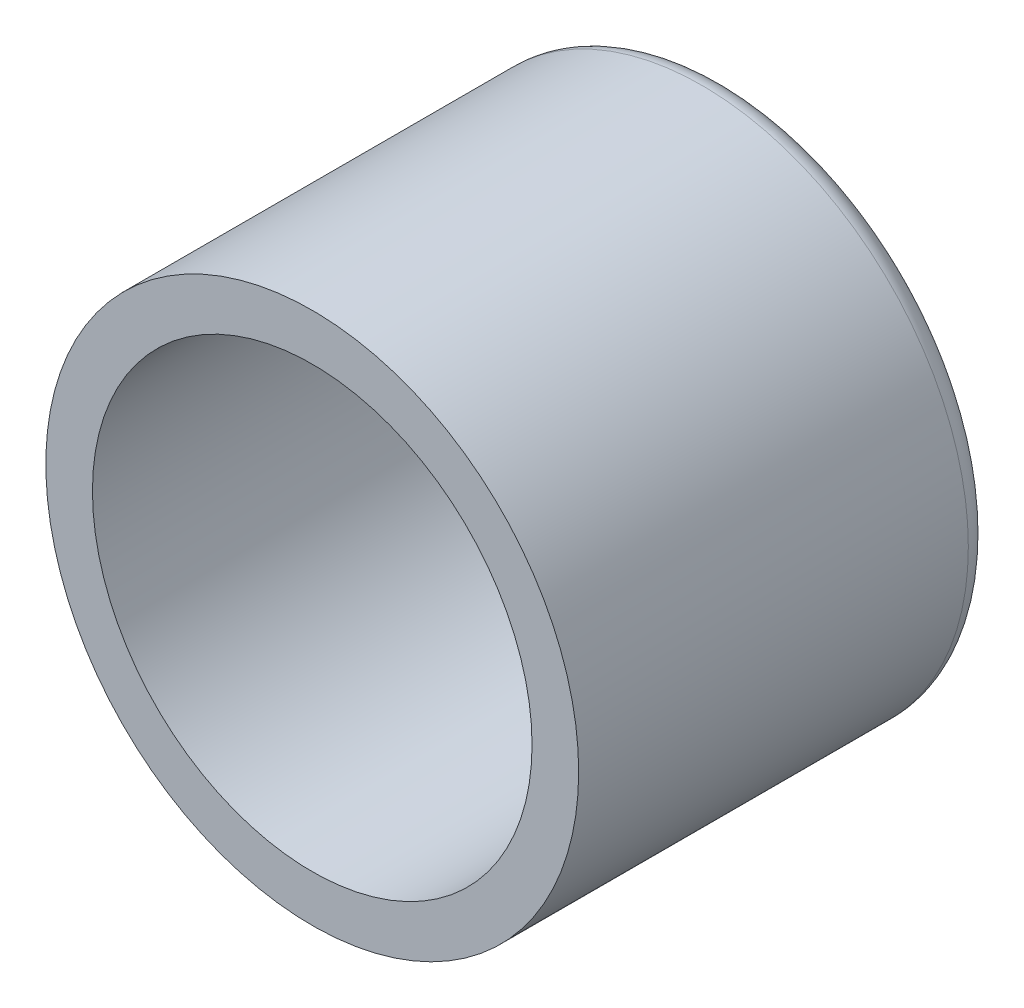
ISO-10303-21;
HEADER;
FILE_DESCRIPTION(('STEP AP214'),'2;1');
FILE_NAME('part.step','',(''),(''),'','','');
FILE_SCHEMA(('AUTOMOTIVE_DESIGN { 1 0 10303 214 1 1 1 1 }'));
ENDSEC;
DATA;
#1=APPLICATION_CONTEXT('core data for automotive mechanical design processes');
#2=APPLICATION_PROTOCOL_DEFINITION('international standard','automotive_design',2000,#1);
#3=PRODUCT_CONTEXT('',#1,'mechanical');
#4=PRODUCT('Part','Part','',(#3));
#5=PRODUCT_RELATED_PRODUCT_CATEGORY('part','',(#4));
#6=PRODUCT_DEFINITION_FORMATION('','',#4);
#7=PRODUCT_DEFINITION_CONTEXT('part definition',#1,'design');
#8=PRODUCT_DEFINITION('design','',#6,#7);
#9=PRODUCT_DEFINITION_SHAPE('','',#8);
#10=(LENGTH_UNIT() NAMED_UNIT(*) SI_UNIT(.MILLI.,.METRE.));
#11=(NAMED_UNIT(*) PLANE_ANGLE_UNIT() SI_UNIT($,.RADIAN.));
#12=(NAMED_UNIT(*) SI_UNIT($,.STERADIAN.) SOLID_ANGLE_UNIT());
#13=UNCERTAINTY_MEASURE_WITH_UNIT(LENGTH_MEASURE(1.E-05),#10,'distance_accuracy_value','');
#14=(GEOMETRIC_REPRESENTATION_CONTEXT(3) GLOBAL_UNCERTAINTY_ASSIGNED_CONTEXT((#13)) GLOBAL_UNIT_ASSIGNED_CONTEXT((#10,
#11,#12)) REPRESENTATION_CONTEXT('',''));
#15=CARTESIAN_POINT('',(0.,0.,0.));
#16=DIRECTION('',(0.,0.,1.));
#17=DIRECTION('',(1.,0.,0.));
#18=AXIS2_PLACEMENT_3D('',#15,#16,#17);
#19=CARTESIAN_POINT('',(0.,0.,12.4));
#20=DIRECTION('',(0.,0.,1.));
#21=DIRECTION('',(1.,0.,0.));
#22=AXIS2_PLACEMENT_3D('',#19,#20,#21);
#23=PLANE('',#22);
#24=CARTESIAN_POINT('',(0.,0.,12.4));
#25=DIRECTION('',(0.,0.,1.));
#26=DIRECTION('',(1.,0.,0.));
#27=AXIS2_PLACEMENT_3D('',#24,#25,#26);
#28=CIRCLE('',#27,8.);
#29=CARTESIAN_POINT('',(8.,0.,12.4));
#30=VERTEX_POINT('',#29);
#31=EDGE_CURVE('E41',#30,#30,#28,.T.);
#32=ORIENTED_EDGE('',*,*,#31,.T.);
#33=EDGE_LOOP('',(#32));
#34=FACE_BOUND('',#33,.T.);
#35=CARTESIAN_POINT('',(0.,0.,12.4));
#36=DIRECTION('',(0.,0.,1.));
#37=DIRECTION('',(1.,0.,0.));
#38=AXIS2_PLACEMENT_3D('',#35,#36,#37);
#39=CIRCLE('',#38,6.6);
#40=CARTESIAN_POINT('',(6.6,0.,12.4));
#41=VERTEX_POINT('',#40);
#42=EDGE_CURVE('E45',#41,#41,#39,.T.);
#43=ORIENTED_EDGE('',*,*,#42,.F.);
#44=EDGE_LOOP('',(#43));
#45=FACE_BOUND('',#44,.T.);
#46=ADVANCED_FACE('F30',(#34,#45),#23,.T.);
#47=CARTESIAN_POINT('',(0.,0.,0.));
#48=DIRECTION('',(0.,0.,1.));
#49=DIRECTION('',(1.,0.,0.));
#50=AXIS2_PLACEMENT_3D('',#47,#48,#49);
#51=PLANE('',#50);
#52=CARTESIAN_POINT('',(0.,0.,0.));
#53=DIRECTION('',(0.,0.,1.));
#54=DIRECTION('',(1.,0.,0.));
#55=AXIS2_PLACEMENT_3D('',#52,#53,#54);
#56=CIRCLE('',#55,7.3);
#57=CARTESIAN_POINT('',(7.3,0.,0.));
#58=VERTEX_POINT('',#57);
#59=EDGE_CURVE('E10',#58,#58,#56,.F.);
#60=ORIENTED_EDGE('',*,*,#59,.T.);
#61=EDGE_LOOP('',(#60));
#62=FACE_BOUND('',#61,.T.);
#63=CARTESIAN_POINT('',(0.,0.,0.));
#64=DIRECTION('',(0.,0.,1.));
#65=DIRECTION('',(1.,0.,0.));
#66=AXIS2_PLACEMENT_3D('',#63,#64,#65);
#67=CIRCLE('',#66,6.6);
#68=CARTESIAN_POINT('',(6.6,0.,0.));
#69=VERTEX_POINT('',#68);
#70=EDGE_CURVE('E48',#69,#69,#67,.T.);
#71=ORIENTED_EDGE('',*,*,#70,.T.);
#72=EDGE_LOOP('',(#71));
#73=FACE_BOUND('',#72,.T.);
#74=ADVANCED_FACE('F58',(#62,#73),#51,.F.);
#75=CARTESIAN_POINT('',(0.,0.,12.4));
#76=DIRECTION('',(0.,0.,-1.));
#77=DIRECTION('',(-1.,0.,0.));
#78=AXIS2_PLACEMENT_3D('',#75,#76,#77);
#79=CYLINDRICAL_SURFACE('',#78,8.);
#80=CARTESIAN_POINT('',(0.,0.,0.699999999999999));
#81=DIRECTION('',(0.,0.,1.));
#82=DIRECTION('',(1.,0.,0.));
#83=AXIS2_PLACEMENT_3D('',#80,#81,#82);
#84=CIRCLE('',#83,8.);
#85=CARTESIAN_POINT('',(8.,0.,0.699999999999999));
#86=VERTEX_POINT('',#85);
#87=EDGE_CURVE('E37',#86,#86,#84,.T.);
#88=ORIENTED_EDGE('',*,*,#87,.T.);
#89=EDGE_LOOP('',(#88));
#90=FACE_BOUND('',#89,.T.);
#91=ORIENTED_EDGE('',*,*,#31,.F.);
#92=EDGE_LOOP('',(#91));
#93=FACE_BOUND('',#92,.T.);
#94=ADVANCED_FACE('F64',(#90,#93),#79,.T.);
#95=CARTESIAN_POINT('',(0.,0.,12.4));
#96=DIRECTION('',(0.,0.,-1.));
#97=DIRECTION('',(-1.,0.,0.));
#98=AXIS2_PLACEMENT_3D('',#95,#96,#97);
#99=CYLINDRICAL_SURFACE('',#98,6.6);
#100=ORIENTED_EDGE('',*,*,#42,.T.);
#101=EDGE_LOOP('',(#100));
#102=FACE_BOUND('',#101,.T.);
#103=ORIENTED_EDGE('',*,*,#70,.F.);
#104=EDGE_LOOP('',(#103));
#105=FACE_BOUND('',#104,.T.);
#106=ADVANCED_FACE('F54',(#102,#105),#99,.F.);
#107=CARTESIAN_POINT('',(0.,0.,0.699999999999999));
#108=DIRECTION('',(0.,0.,1.));
#109=DIRECTION('',(1.,0.,0.));
#110=AXIS2_PLACEMENT_3D('',#107,#108,#109);
#111=TOROIDAL_SURFACE('',#110,7.3,0.7);
#112=ORIENTED_EDGE('',*,*,#59,.F.);
#113=EDGE_LOOP('',(#112));
#114=FACE_BOUND('',#113,.T.);
#115=ORIENTED_EDGE('',*,*,#87,.F.);
#116=EDGE_LOOP('',(#115));
#117=FACE_BOUND('',#116,.T.);
#118=ADVANCED_FACE('F32',(#114,#117),#111,.T.);
#119=CLOSED_SHELL('',(#46,#74,#94,#106,#118));
#120=MANIFOLD_SOLID_BREP('B2',#119);
#121=ADVANCED_BREP_SHAPE_REPRESENTATION('',(#18,#120),#14);
#122=SHAPE_DEFINITION_REPRESENTATION(#9,#121);
ENDSEC;
END-ISO-10303-21;
